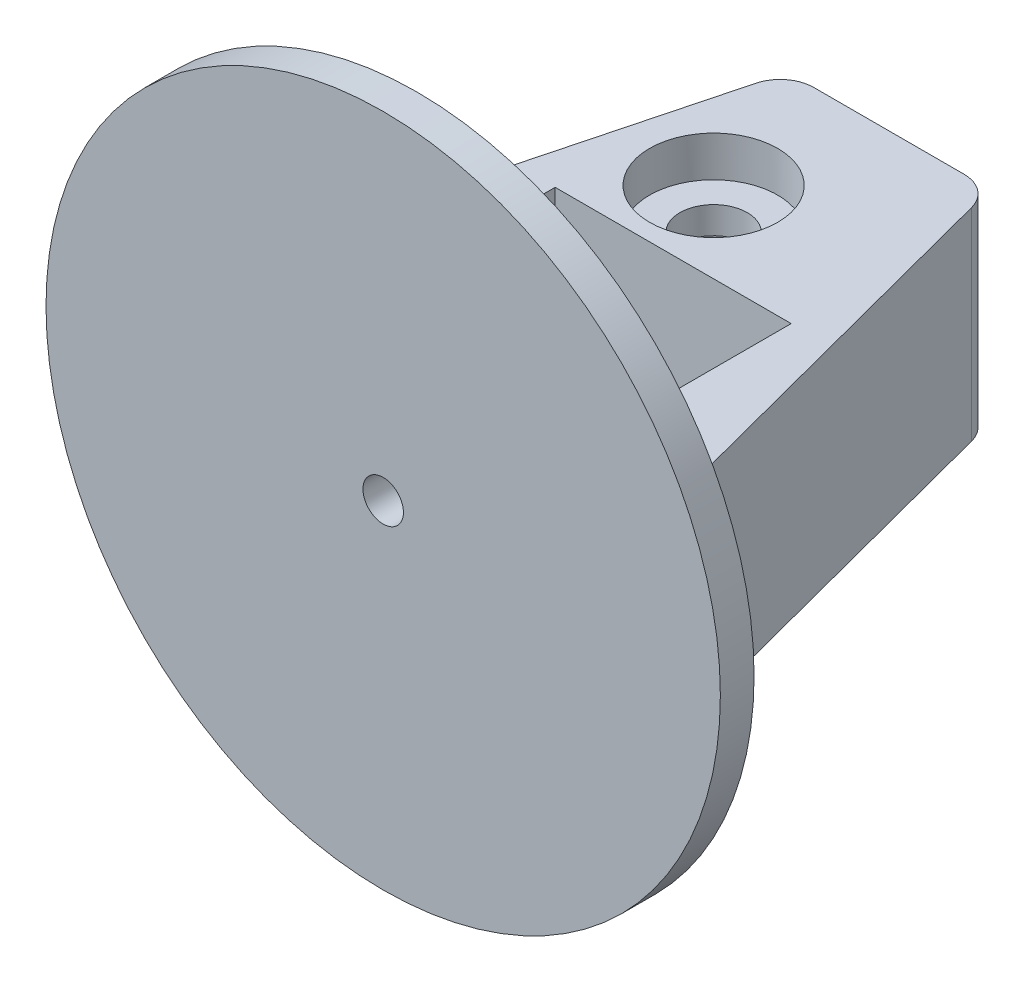
ISO-10303-21;
HEADER;
FILE_DESCRIPTION(('STEP AP214'),'2;1');
FILE_NAME('part.step','',(''),(''),'','','');
FILE_SCHEMA(('AUTOMOTIVE_DESIGN { 1 0 10303 214 1 1 1 1 }'));
ENDSEC;
DATA;
#1=APPLICATION_CONTEXT('core data for automotive mechanical design processes');
#2=APPLICATION_PROTOCOL_DEFINITION('international standard','automotive_design',2000,#1);
#3=PRODUCT_CONTEXT('',#1,'mechanical');
#4=PRODUCT('Part','Part','',(#3));
#5=PRODUCT_RELATED_PRODUCT_CATEGORY('part','',(#4));
#6=PRODUCT_DEFINITION_FORMATION('','',#4);
#7=PRODUCT_DEFINITION_CONTEXT('part definition',#1,'design');
#8=PRODUCT_DEFINITION('design','',#6,#7);
#9=PRODUCT_DEFINITION_SHAPE('','',#8);
#10=(LENGTH_UNIT() NAMED_UNIT(*) SI_UNIT(.MILLI.,.METRE.));
#11=(NAMED_UNIT(*) PLANE_ANGLE_UNIT() SI_UNIT($,.RADIAN.));
#12=(NAMED_UNIT(*) SI_UNIT($,.STERADIAN.) SOLID_ANGLE_UNIT());
#13=UNCERTAINTY_MEASURE_WITH_UNIT(LENGTH_MEASURE(1.E-05),#10,'distance_accuracy_value','');
#14=(GEOMETRIC_REPRESENTATION_CONTEXT(3) GLOBAL_UNCERTAINTY_ASSIGNED_CONTEXT((#13)) GLOBAL_UNIT_ASSIGNED_CONTEXT((#10,
#11,#12)) REPRESENTATION_CONTEXT('',''));
#15=CARTESIAN_POINT('',(0.,0.,0.));
#16=DIRECTION('',(0.,0.,1.));
#17=DIRECTION('',(1.,0.,0.));
#18=AXIS2_PLACEMENT_3D('',#15,#16,#17);
#19=CARTESIAN_POINT('',(-5.99999999999999,40.,-50.));
#20=DIRECTION('',(0.,-1.,0.));
#21=DIRECTION('',(0.,0.,-1.));
#22=AXIS2_PLACEMENT_3D('',#19,#20,#21);
#23=CYLINDRICAL_SURFACE('',#22,5.);
#24=CARTESIAN_POINT('',(-5.99999999999999,20.,-50.));
#25=DIRECTION('',(0.,-1.,0.));
#26=DIRECTION('',(0.,0.,-1.));
#27=AXIS2_PLACEMENT_3D('',#24,#25,#26);
#28=CIRCLE('',#27,5.);
#29=CARTESIAN_POINT('',(-5.99999999999999,20.,-55.));
#30=VERTEX_POINT('',#29);
#31=EDGE_CURVE('E146',#30,#30,#28,.T.);
#32=ORIENTED_EDGE('',*,*,#31,.T.);
#33=EDGE_LOOP('',(#32));
#34=FACE_BOUND('',#33,.T.);
#35=CARTESIAN_POINT('',(-5.99999999999999,24.,-50.));
#36=DIRECTION('',(0.,1.,0.));
#37=DIRECTION('',(0.,0.,1.));
#38=AXIS2_PLACEMENT_3D('',#35,#36,#37);
#39=CIRCLE('',#38,5.);
#40=CARTESIAN_POINT('',(-5.99999999999999,24.,-45.));
#41=VERTEX_POINT('',#40);
#42=EDGE_CURVE('E144',#41,#41,#39,.F.);
#43=ORIENTED_EDGE('',*,*,#42,.F.);
#44=EDGE_LOOP('',(#43));
#45=FACE_BOUND('',#44,.T.);
#46=ADVANCED_FACE('F36',(#34,#45),#23,.F.);
#47=CARTESIAN_POINT('',(-11.141347684202,40.,-65.));
#48=DIRECTION('',(0.,-1.,0.));
#49=DIRECTION('',(0.,0.,-1.));
#50=AXIS2_PLACEMENT_3D('',#47,#48,#49);
#51=CYLINDRICAL_SURFACE('',#50,5.);
#52=DIRECTION('',(0.,-1.,0.));
#53=VECTOR('',#52,1.);
#54=CARTESIAN_POINT('',(-15.978061053794,40.,-66.2673609511146));
#55=LINE('',#54,#53);
#56=CARTESIAN_POINT('',(-15.978061053794,30.,-66.2673609511146));
#57=VERTEX_POINT('',#56);
#58=CARTESIAN_POINT('',(-15.978061053794,0.,-66.2673609511146));
#59=VERTEX_POINT('',#58);
#60=EDGE_CURVE('E11',#57,#59,#55,.T.);
#61=ORIENTED_EDGE('',*,*,#60,.F.);
#62=CARTESIAN_POINT('',(-11.141347684202,30.,-65.));
#63=DIRECTION('',(0.,-1.,0.));
#64=DIRECTION('',(0.,0.,-1.));
#65=AXIS2_PLACEMENT_3D('',#62,#63,#64);
#66=CIRCLE('',#65,5.);
#67=CARTESIAN_POINT('',(-11.141347684202,30.,-70.));
#68=VERTEX_POINT('',#67);
#69=EDGE_CURVE('E120',#57,#68,#66,.T.);
#70=ORIENTED_EDGE('',*,*,#69,.T.);
#71=DIRECTION('',(0.,-1.,0.));
#72=VECTOR('',#71,1.);
#73=CARTESIAN_POINT('',(-11.141347684202,40.,-70.));
#74=LINE('',#73,#72);
#75=CARTESIAN_POINT('',(-11.141347684202,0.,-70.));
#76=VERTEX_POINT('',#75);
#77=EDGE_CURVE('E185',#68,#76,#74,.T.);
#78=ORIENTED_EDGE('',*,*,#77,.T.);
#79=CARTESIAN_POINT('',(-11.141347684202,0.,-65.));
#80=DIRECTION('',(0.,1.,0.));
#81=DIRECTION('',(0.,0.,1.));
#82=AXIS2_PLACEMENT_3D('',#79,#80,#81);
#83=CIRCLE('',#82,5.);
#84=EDGE_CURVE('E168',#76,#59,#83,.T.);
#85=ORIENTED_EDGE('',*,*,#84,.T.);
#86=EDGE_LOOP('',(#61,#70,#78,#85));
#87=FACE_BOUND('',#86,.T.);
#88=ADVANCED_FACE('F38',(#87),#51,.T.);
#89=CARTESIAN_POINT('',(-33.3420558133058,40.,0.));
#90=DIRECTION('',(0.9673426739184,0.,0.253472190222911));
#91=DIRECTION('',(0.253472190222911,0.,-0.9673426739184));
#92=AXIS2_PLACEMENT_3D('',#89,#90,#91);
#93=PLANE('',#92);
#94=DIRECTION('',(0.,-1.,0.));
#95=VECTOR('',#94,1.);
#96=CARTESIAN_POINT('',(-33.3420558133058,40.,0.));
#97=LINE('',#96,#95);
#98=CARTESIAN_POINT('',(-33.3420558133058,30.,0.));
#99=VERTEX_POINT('',#98);
#100=CARTESIAN_POINT('',(-33.3420558133058,0.,0.));
#101=VERTEX_POINT('',#100);
#102=EDGE_CURVE('E45',#99,#101,#97,.T.);
#103=ORIENTED_EDGE('',*,*,#102,.F.);
#104=DIRECTION('',(0.253472190222911,0.,-0.9673426739184));
#105=VECTOR('',#104,1.);
#106=CARTESIAN_POINT('',(-33.3420558133058,30.,0.));
#107=LINE('',#106,#105);
#108=EDGE_CURVE('E114',#99,#57,#107,.T.);
#109=ORIENTED_EDGE('',*,*,#108,.T.);
#110=ORIENTED_EDGE('',*,*,#60,.T.);
#111=DIRECTION('',(-0.253472190222911,0.,0.9673426739184));
#112=VECTOR('',#111,1.);
#113=CARTESIAN_POINT('',(-33.3420558133058,0.,0.));
#114=LINE('',#113,#112);
#115=EDGE_CURVE('E139',#59,#101,#114,.T.);
#116=ORIENTED_EDGE('',*,*,#115,.T.);
#117=EDGE_LOOP('',(#103,#109,#110,#116));
#118=FACE_BOUND('',#117,.T.);
#119=ADVANCED_FACE('F137',(#118),#93,.F.);
#120=CARTESIAN_POINT('',(15.978061053794,40.,-66.2673609511146));
#121=DIRECTION('',(-0.9673426739184,0.,0.253472190222911));
#122=DIRECTION('',(0.253472190222911,0.,0.9673426739184));
#123=AXIS2_PLACEMENT_3D('',#120,#121,#122);
#124=PLANE('',#123);
#125=DIRECTION('',(0.,-1.,0.));
#126=VECTOR('',#125,1.);
#127=CARTESIAN_POINT('',(15.978061053794,40.,-66.2673609511146));
#128=LINE('',#127,#126);
#129=CARTESIAN_POINT('',(15.978061053794,30.,-66.2673609511146));
#130=VERTEX_POINT('',#129);
#131=CARTESIAN_POINT('',(15.978061053794,0.,-66.2673609511146));
#132=VERTEX_POINT('',#131);
#133=EDGE_CURVE('E141',#130,#132,#128,.T.);
#134=ORIENTED_EDGE('',*,*,#133,.F.);
#135=DIRECTION('',(0.253472190222911,0.,0.9673426739184));
#136=VECTOR('',#135,1.);
#137=CARTESIAN_POINT('',(15.978061053794,30.,-66.2673609511146));
#138=LINE('',#137,#136);
#139=CARTESIAN_POINT('',(33.3420558133058,30.,0.));
#140=VERTEX_POINT('',#139);
#141=EDGE_CURVE('E209',#130,#140,#138,.T.);
#142=ORIENTED_EDGE('',*,*,#141,.T.);
#143=DIRECTION('',(0.,-1.,0.));
#144=VECTOR('',#143,1.);
#145=CARTESIAN_POINT('',(33.3420558133058,40.,0.));
#146=LINE('',#145,#144);
#147=CARTESIAN_POINT('',(33.3420558133058,0.,0.));
#148=VERTEX_POINT('',#147);
#149=EDGE_CURVE('E132',#140,#148,#146,.T.);
#150=ORIENTED_EDGE('',*,*,#149,.T.);
#151=DIRECTION('',(-0.253472190222911,0.,-0.9673426739184));
#152=VECTOR('',#151,1.);
#153=CARTESIAN_POINT('',(15.978061053794,0.,-66.2673609511146));
#154=LINE('',#153,#152);
#155=EDGE_CURVE('E176',#148,#132,#154,.T.);
#156=ORIENTED_EDGE('',*,*,#155,.T.);
#157=EDGE_LOOP('',(#134,#142,#150,#156));
#158=FACE_BOUND('',#157,.T.);
#159=ADVANCED_FACE('F198',(#158),#124,.F.);
#160=CARTESIAN_POINT('',(11.141347684202,40.,-65.));
#161=DIRECTION('',(0.,-1.,0.));
#162=DIRECTION('',(0.,0.,-1.));
#163=AXIS2_PLACEMENT_3D('',#160,#161,#162);
#164=CYLINDRICAL_SURFACE('',#163,5.);
#165=DIRECTION('',(0.,-1.,0.));
#166=VECTOR('',#165,1.);
#167=CARTESIAN_POINT('',(11.141347684202,40.,-70.));
#168=LINE('',#167,#166);
#169=CARTESIAN_POINT('',(11.141347684202,30.,-70.));
#170=VERTEX_POINT('',#169);
#171=CARTESIAN_POINT('',(11.141347684202,0.,-70.));
#172=VERTEX_POINT('',#171);
#173=EDGE_CURVE('E187',#170,#172,#168,.T.);
#174=ORIENTED_EDGE('',*,*,#173,.F.);
#175=CARTESIAN_POINT('',(11.141347684202,30.,-65.));
#176=DIRECTION('',(0.,-1.,0.));
#177=DIRECTION('',(0.,0.,-1.));
#178=AXIS2_PLACEMENT_3D('',#175,#176,#177);
#179=CIRCLE('',#178,5.);
#180=EDGE_CURVE('E195',#170,#130,#179,.T.);
#181=ORIENTED_EDGE('',*,*,#180,.T.);
#182=ORIENTED_EDGE('',*,*,#133,.T.);
#183=CARTESIAN_POINT('',(11.141347684202,0.,-65.));
#184=DIRECTION('',(0.,1.,0.));
#185=DIRECTION('',(0.,0.,-1.));
#186=AXIS2_PLACEMENT_3D('',#183,#184,#185);
#187=CIRCLE('',#186,5.);
#188=EDGE_CURVE('E179',#132,#172,#187,.T.);
#189=ORIENTED_EDGE('',*,*,#188,.T.);
#190=EDGE_LOOP('',(#174,#181,#182,#189));
#191=FACE_BOUND('',#190,.T.);
#192=ADVANCED_FACE('F192',(#191),#164,.T.);
#193=CARTESIAN_POINT('',(-11.141347684202,40.,-70.));
#194=DIRECTION('',(0.,0.,1.));
#195=DIRECTION('',(1.,0.,0.));
#196=AXIS2_PLACEMENT_3D('',#193,#194,#195);
#197=PLANE('',#196);
#198=ORIENTED_EDGE('',*,*,#77,.F.);
#199=DIRECTION('',(1.,0.,0.));
#200=VECTOR('',#199,1.);
#201=CARTESIAN_POINT('',(-11.141347684202,30.,-70.));
#202=LINE('',#201,#200);
#203=EDGE_CURVE('E206',#68,#170,#202,.T.);
#204=ORIENTED_EDGE('',*,*,#203,.T.);
#205=ORIENTED_EDGE('',*,*,#173,.T.);
#206=DIRECTION('',(-1.,0.,0.));
#207=VECTOR('',#206,1.);
#208=CARTESIAN_POINT('',(-11.141347684202,0.,-70.));
#209=LINE('',#208,#207);
#210=EDGE_CURVE('E182',#172,#76,#209,.T.);
#211=ORIENTED_EDGE('',*,*,#210,.T.);
#212=EDGE_LOOP('',(#198,#204,#205,#211));
#213=FACE_BOUND('',#212,.T.);
#214=ADVANCED_FACE('F204',(#213),#197,.F.);
#215=CARTESIAN_POINT('',(-11.141347684202,0.,-65.));
#216=DIRECTION('',(0.,1.,0.));
#217=DIRECTION('',(0.,0.,1.));
#218=AXIS2_PLACEMENT_3D('',#215,#216,#217);
#219=PLANE('',#218);
#220=CARTESIAN_POINT('',(-11.3501899868682,0.,-14.3499999999996));
#221=DIRECTION('',(0.,-1.,0.));
#222=DIRECTION('',(0.,0.,-1.));
#223=AXIS2_PLACEMENT_3D('',#220,#221,#222);
#224=CIRCLE('',#223,1.50000000000009);
#225=CARTESIAN_POINT('',(-11.3501899868682,0.,-15.8499999999997));
#226=VERTEX_POINT('',#225);
#227=EDGE_CURVE('E270',#226,#226,#224,.T.);
#228=ORIENTED_EDGE('',*,*,#227,.F.);
#229=EDGE_LOOP('',(#228));
#230=FACE_BOUND('',#229,.T.);
#231=CARTESIAN_POINT('',(-1.35018998686818,0.,-14.3499999999996));
#232=DIRECTION('',(0.,-1.,0.));
#233=DIRECTION('',(0.,0.,-1.));
#234=AXIS2_PLACEMENT_3D('',#231,#232,#233);
#235=CIRCLE('',#234,1.5000000000001);
#236=CARTESIAN_POINT('',(-1.35018998686818,0.,-15.8499999999997));
#237=VERTEX_POINT('',#236);
#238=EDGE_CURVE('E264',#237,#237,#235,.T.);
#239=ORIENTED_EDGE('',*,*,#238,.F.);
#240=EDGE_LOOP('',(#239));
#241=FACE_BOUND('',#240,.T.);
#242=CARTESIAN_POINT('',(-1.35018998686803,0.,-64.8499999999998));
#243=DIRECTION('',(0.,-1.,0.));
#244=DIRECTION('',(0.,0.,-1.));
#245=AXIS2_PLACEMENT_3D('',#242,#243,#244);
#246=CIRCLE('',#245,1.5);
#247=CARTESIAN_POINT('',(-1.35018998686803,0.,-66.3499999999998));
#248=VERTEX_POINT('',#247);
#249=EDGE_CURVE('E259',#248,#248,#246,.T.);
#250=ORIENTED_EDGE('',*,*,#249,.F.);
#251=EDGE_LOOP('',(#250));
#252=FACE_BOUND('',#251,.T.);
#253=CARTESIAN_POINT('',(-11.350189986868,0.,-64.8499999999998));
#254=DIRECTION('',(0.,-1.,0.));
#255=DIRECTION('',(0.,0.,-1.));
#256=AXIS2_PLACEMENT_3D('',#253,#254,#255);
#257=CIRCLE('',#256,1.5);
#258=CARTESIAN_POINT('',(-11.350189986868,0.,-66.3499999999998));
#259=VERTEX_POINT('',#258);
#260=EDGE_CURVE('E252',#259,#259,#257,.T.);
#261=ORIENTED_EDGE('',*,*,#260,.F.);
#262=EDGE_LOOP('',(#261));
#263=FACE_BOUND('',#262,.T.);
#264=DIRECTION('',(1.,0.,0.));
#265=VECTOR('',#264,1.);
#266=CARTESIAN_POINT('',(-17.5,0.,-18.));
#267=LINE('',#266,#265);
#268=CARTESIAN_POINT('',(-17.5,0.,-18.));
#269=VERTEX_POINT('',#268);
#270=CARTESIAN_POINT('',(17.5,0.,-18.));
#271=VERTEX_POINT('',#270);
#272=EDGE_CURVE('E233',#269,#271,#267,.T.);
#273=ORIENTED_EDGE('',*,*,#272,.T.);
#274=DIRECTION('',(0.,0.,-1.));
#275=VECTOR('',#274,1.);
#276=CARTESIAN_POINT('',(17.5,0.,-18.));
#277=LINE('',#276,#275);
#278=CARTESIAN_POINT('',(17.5,0.,-38.));
#279=VERTEX_POINT('',#278);
#280=EDGE_CURVE('E226',#271,#279,#277,.T.);
#281=ORIENTED_EDGE('',*,*,#280,.T.);
#282=DIRECTION('',(-1.,0.,0.));
#283=VECTOR('',#282,1.);
#284=CARTESIAN_POINT('',(-17.5,0.,-38.));
#285=LINE('',#284,#283);
#286=CARTESIAN_POINT('',(-17.5,0.,-38.));
#287=VERTEX_POINT('',#286);
#288=EDGE_CURVE('E229',#279,#287,#285,.T.);
#289=ORIENTED_EDGE('',*,*,#288,.T.);
#290=DIRECTION('',(0.,0.,1.));
#291=VECTOR('',#290,1.);
#292=CARTESIAN_POINT('',(-17.5,0.,-18.));
#293=LINE('',#292,#291);
#294=EDGE_CURVE('E61',#287,#269,#293,.T.);
#295=ORIENTED_EDGE('',*,*,#294,.T.);
#296=EDGE_LOOP('',(#273,#281,#289,#295));
#297=FACE_BOUND('',#296,.T.);
#298=CARTESIAN_POINT('',(-5.99999999999999,0.,-50.));
#299=DIRECTION('',(0.,-1.,0.));
#300=DIRECTION('',(0.,0.,-1.));
#301=AXIS2_PLACEMENT_3D('',#298,#299,#300);
#302=CIRCLE('',#301,9.5);
#303=CARTESIAN_POINT('',(-5.99999999999999,0.,-59.5));
#304=VERTEX_POINT('',#303);
#305=EDGE_CURVE('E151',#304,#304,#302,.T.);
#306=ORIENTED_EDGE('',*,*,#305,.F.);
#307=EDGE_LOOP('',(#306));
#308=FACE_BOUND('',#307,.T.);
#309=ORIENTED_EDGE('',*,*,#84,.F.);
#310=ORIENTED_EDGE('',*,*,#210,.F.);
#311=ORIENTED_EDGE('',*,*,#188,.F.);
#312=ORIENTED_EDGE('',*,*,#155,.F.);
#313=DIRECTION('',(1.,0.,0.));
#314=VECTOR('',#313,1.);
#315=CARTESIAN_POINT('',(33.3420558133058,0.,0.));
#316=LINE('',#315,#314);
#317=EDGE_CURVE('E174',#101,#148,#316,.T.);
#318=ORIENTED_EDGE('',*,*,#317,.F.);
#319=ORIENTED_EDGE('',*,*,#115,.F.);
#320=EDGE_LOOP('',(#309,#310,#311,#312,#318,#319));
#321=FACE_BOUND('',#320,.T.);
#322=ADVANCED_FACE('F201',(#230,#241,#252,#263,#297,#308,#321),#219,.F.);
#323=CARTESIAN_POINT('',(-5.99999999999999,20.,-50.));
#324=DIRECTION('',(0.,-1.,0.));
#325=DIRECTION('',(0.,0.,-1.));
#326=AXIS2_PLACEMENT_3D('',#323,#324,#325);
#327=CYLINDRICAL_SURFACE('',#326,9.5);
#328=CARTESIAN_POINT('',(-5.99999999999999,20.,-50.));
#329=DIRECTION('',(0.,-1.,0.));
#330=DIRECTION('',(0.,0.,-1.));
#331=AXIS2_PLACEMENT_3D('',#328,#329,#330);
#332=CIRCLE('',#331,9.5);
#333=CARTESIAN_POINT('',(-5.99999999999999,20.,-59.5));
#334=VERTEX_POINT('',#333);
#335=EDGE_CURVE('E165',#334,#334,#332,.T.);
#336=ORIENTED_EDGE('',*,*,#335,.F.);
#337=EDGE_LOOP('',(#336));
#338=FACE_BOUND('',#337,.T.);
#339=ORIENTED_EDGE('',*,*,#305,.T.);
#340=EDGE_LOOP('',(#339));
#341=FACE_BOUND('',#340,.T.);
#342=ADVANCED_FACE('F287',(#338,#341),#327,.F.);
#343=CARTESIAN_POINT('',(-5.99999999999999,20.,-50.));
#344=DIRECTION('',(0.,-1.,0.));
#345=DIRECTION('',(0.,0.,-1.));
#346=AXIS2_PLACEMENT_3D('',#343,#344,#345);
#347=PLANE('',#346);
#348=ORIENTED_EDGE('',*,*,#31,.F.);
#349=EDGE_LOOP('',(#348));
#350=FACE_BOUND('',#349,.T.);
#351=ORIENTED_EDGE('',*,*,#335,.T.);
#352=EDGE_LOOP('',(#351));
#353=FACE_BOUND('',#352,.T.);
#354=ADVANCED_FACE('F300',(#350,#353),#347,.T.);
#355=CARTESIAN_POINT('',(-5.99999999999999,24.,-50.));
#356=DIRECTION('',(0.,1.,0.));
#357=DIRECTION('',(0.,0.,1.));
#358=AXIS2_PLACEMENT_3D('',#355,#356,#357);
#359=PLANE('',#358);
#360=CARTESIAN_POINT('',(-5.99999999999999,24.,-50.));
#361=DIRECTION('',(0.,1.,0.));
#362=DIRECTION('',(0.,0.,1.));
#363=AXIS2_PLACEMENT_3D('',#360,#361,#362);
#364=CIRCLE('',#363,9.5);
#365=CARTESIAN_POINT('',(-5.99999999999999,24.,-40.5));
#366=VERTEX_POINT('',#365);
#367=EDGE_CURVE('E147',#366,#366,#364,.T.);
#368=ORIENTED_EDGE('',*,*,#367,.T.);
#369=EDGE_LOOP('',(#368));
#370=FACE_BOUND('',#369,.T.);
#371=ORIENTED_EDGE('',*,*,#42,.T.);
#372=EDGE_LOOP('',(#371));
#373=FACE_BOUND('',#372,.T.);
#374=ADVANCED_FACE('F307',(#370,#373),#359,.T.);
#375=CARTESIAN_POINT('',(-5.99999999999999,24.,-50.));
#376=DIRECTION('',(0.,1.,0.));
#377=DIRECTION('',(0.,0.,1.));
#378=AXIS2_PLACEMENT_3D('',#375,#376,#377);
#379=CYLINDRICAL_SURFACE('',#378,9.5);
#380=CARTESIAN_POINT('',(-5.99999999999999,30.,-50.));
#381=DIRECTION('',(0.,-1.,0.));
#382=DIRECTION('',(0.,0.,-1.));
#383=AXIS2_PLACEMENT_3D('',#380,#381,#382);
#384=CIRCLE('',#383,9.5);
#385=CARTESIAN_POINT('',(-5.99999999999999,30.,-59.5));
#386=VERTEX_POINT('',#385);
#387=EDGE_CURVE('E207',#386,#386,#384,.F.);
#388=ORIENTED_EDGE('',*,*,#387,.T.);
#389=EDGE_LOOP('',(#388));
#390=FACE_BOUND('',#389,.T.);
#391=ORIENTED_EDGE('',*,*,#367,.F.);
#392=EDGE_LOOP('',(#391));
#393=FACE_BOUND('',#392,.T.);
#394=ADVANCED_FACE('F320',(#390,#393),#379,.F.);
#395=CARTESIAN_POINT('',(17.5,0.,-18.));
#396=DIRECTION('',(1.,0.,0.));
#397=DIRECTION('',(0.,0.,-1.));
#398=AXIS2_PLACEMENT_3D('',#395,#396,#397);
#399=PLANE('',#398);
#400=DIRECTION('',(0.,1.,0.));
#401=VECTOR('',#400,1.);
#402=CARTESIAN_POINT('',(17.5,0.,-18.));
#403=LINE('',#402,#401);
#404=CARTESIAN_POINT('',(17.5,30.,-18.));
#405=VERTEX_POINT('',#404);
#406=EDGE_CURVE('E154',#271,#405,#403,.T.);
#407=ORIENTED_EDGE('',*,*,#406,.T.);
#408=DIRECTION('',(0.,0.,-1.));
#409=VECTOR('',#408,1.);
#410=CARTESIAN_POINT('',(17.5,30.,-18.));
#411=LINE('',#410,#409);
#412=CARTESIAN_POINT('',(17.5,30.,-38.));
#413=VERTEX_POINT('',#412);
#414=EDGE_CURVE('E212',#405,#413,#411,.T.);
#415=ORIENTED_EDGE('',*,*,#414,.T.);
#416=DIRECTION('',(0.,1.,0.));
#417=VECTOR('',#416,1.);
#418=CARTESIAN_POINT('',(17.5,0.,-38.));
#419=LINE('',#418,#417);
#420=EDGE_CURVE('E162',#279,#413,#419,.T.);
#421=ORIENTED_EDGE('',*,*,#420,.F.);
#422=ORIENTED_EDGE('',*,*,#280,.F.);
#423=EDGE_LOOP('',(#407,#415,#421,#422));
#424=FACE_BOUND('',#423,.T.);
#425=ADVANCED_FACE('F245',(#424),#399,.F.);
#426=CARTESIAN_POINT('',(-17.5,0.,-18.));
#427=DIRECTION('',(0.,0.,1.));
#428=DIRECTION('',(1.,0.,0.));
#429=AXIS2_PLACEMENT_3D('',#426,#427,#428);
#430=PLANE('',#429);
#431=CARTESIAN_POINT('',(0.,20.,-18.));
#432=DIRECTION('',(0.,0.,1.));
#433=DIRECTION('',(1.,0.,0.));
#434=AXIS2_PLACEMENT_3D('',#431,#432,#433);
#435=CIRCLE('',#434,3.);
#436=CARTESIAN_POINT('',(3.,20.,-18.));
#437=VERTEX_POINT('',#436);
#438=EDGE_CURVE('E40',#437,#437,#435,.T.);
#439=ORIENTED_EDGE('',*,*,#438,.T.);
#440=EDGE_LOOP('',(#439));
#441=FACE_BOUND('',#440,.T.);
#442=DIRECTION('',(0.,1.,0.));
#443=VECTOR('',#442,1.);
#444=CARTESIAN_POINT('',(-17.5,0.,-18.));
#445=LINE('',#444,#443);
#446=CARTESIAN_POINT('',(-17.5,30.,-18.));
#447=VERTEX_POINT('',#446);
#448=EDGE_CURVE('E159',#269,#447,#445,.T.);
#449=ORIENTED_EDGE('',*,*,#448,.T.);
#450=DIRECTION('',(1.,0.,0.));
#451=VECTOR('',#450,1.);
#452=CARTESIAN_POINT('',(-17.5,30.,-18.));
#453=LINE('',#452,#451);
#454=EDGE_CURVE('E247',#447,#405,#453,.T.);
#455=ORIENTED_EDGE('',*,*,#454,.T.);
#456=ORIENTED_EDGE('',*,*,#406,.F.);
#457=ORIENTED_EDGE('',*,*,#272,.F.);
#458=EDGE_LOOP('',(#449,#455,#456,#457));
#459=FACE_BOUND('',#458,.T.);
#460=ADVANCED_FACE('F328',(#441,#459),#430,.F.);
#461=CARTESIAN_POINT('',(-17.5,0.,-18.));
#462=DIRECTION('',(-1.,0.,0.));
#463=DIRECTION('',(0.,0.,1.));
#464=AXIS2_PLACEMENT_3D('',#461,#462,#463);
#465=PLANE('',#464);
#466=DIRECTION('',(0.,1.,0.));
#467=VECTOR('',#466,1.);
#468=CARTESIAN_POINT('',(-17.5,0.,-38.));
#469=LINE('',#468,#467);
#470=CARTESIAN_POINT('',(-17.5,30.,-38.));
#471=VERTEX_POINT('',#470);
#472=EDGE_CURVE('E237',#287,#471,#469,.T.);
#473=ORIENTED_EDGE('',*,*,#472,.T.);
#474=DIRECTION('',(0.,0.,1.));
#475=VECTOR('',#474,1.);
#476=CARTESIAN_POINT('',(-17.5,30.,-18.));
#477=LINE('',#476,#475);
#478=EDGE_CURVE('E53',#471,#447,#477,.T.);
#479=ORIENTED_EDGE('',*,*,#478,.T.);
#480=ORIENTED_EDGE('',*,*,#448,.F.);
#481=ORIENTED_EDGE('',*,*,#294,.F.);
#482=EDGE_LOOP('',(#473,#479,#480,#481));
#483=FACE_BOUND('',#482,.T.);
#484=ADVANCED_FACE('F332',(#483),#465,.F.);
#485=CARTESIAN_POINT('',(-17.5,0.,-38.));
#486=DIRECTION('',(0.,0.,-1.));
#487=DIRECTION('',(-1.,0.,0.));
#488=AXIS2_PLACEMENT_3D('',#485,#486,#487);
#489=PLANE('',#488);
#490=ORIENTED_EDGE('',*,*,#420,.T.);
#491=DIRECTION('',(-1.,0.,0.));
#492=VECTOR('',#491,1.);
#493=CARTESIAN_POINT('',(-17.5,30.,-38.));
#494=LINE('',#493,#492);
#495=EDGE_CURVE('E133',#413,#471,#494,.T.);
#496=ORIENTED_EDGE('',*,*,#495,.T.);
#497=ORIENTED_EDGE('',*,*,#472,.F.);
#498=ORIENTED_EDGE('',*,*,#288,.F.);
#499=EDGE_LOOP('',(#490,#496,#497,#498));
#500=FACE_BOUND('',#499,.T.);
#501=ADVANCED_FACE('F241',(#500),#489,.F.);
#502=CARTESIAN_POINT('',(0.,20.,-25.));
#503=DIRECTION('',(0.,0.,1.));
#504=DIRECTION('',(1.,0.,0.));
#505=AXIS2_PLACEMENT_3D('',#502,#503,#504);
#506=CYLINDRICAL_SURFACE('',#505,3.);
#507=ORIENTED_EDGE('',*,*,#438,.F.);
#508=EDGE_LOOP('',(#507));
#509=FACE_BOUND('',#508,.T.);
#510=CARTESIAN_POINT('',(0.,20.,5.));
#511=DIRECTION('',(0.,0.,1.));
#512=DIRECTION('',(1.,0.,0.));
#513=AXIS2_PLACEMENT_3D('',#510,#511,#512);
#514=CIRCLE('',#513,3.);
#515=CARTESIAN_POINT('',(3.,20.,5.));
#516=VERTEX_POINT('',#515);
#517=EDGE_CURVE('E124',#516,#516,#514,.T.);
#518=ORIENTED_EDGE('',*,*,#517,.T.);
#519=EDGE_LOOP('',(#518));
#520=FACE_BOUND('',#519,.T.);
#521=ADVANCED_FACE('F331',(#509,#520),#506,.F.);
#522=CARTESIAN_POINT('',(0.,20.,0.));
#523=DIRECTION('',(0.,0.,1.));
#524=DIRECTION('',(1.,0.,0.));
#525=AXIS2_PLACEMENT_3D('',#522,#523,#524);
#526=PLANE('',#525);
#527=ORIENTED_EDGE('',*,*,#149,.F.);
#528=DIRECTION('',(1.,0.,0.));
#529=VECTOR('',#528,1.);
#530=CARTESIAN_POINT('',(-33.3420558133058,30.,0.));
#531=LINE('',#530,#529);
#532=EDGE_CURVE('E117',#99,#140,#531,.T.);
#533=ORIENTED_EDGE('',*,*,#532,.F.);
#534=ORIENTED_EDGE('',*,*,#102,.T.);
#535=ORIENTED_EDGE('',*,*,#317,.T.);
#536=EDGE_LOOP('',(#527,#533,#534,#535));
#537=FACE_BOUND('',#536,.T.);
#538=CARTESIAN_POINT('',(0.,20.,0.));
#539=DIRECTION('',(0.,0.,1.));
#540=DIRECTION('',(1.,0.,0.));
#541=AXIS2_PLACEMENT_3D('',#538,#539,#540);
#542=CIRCLE('',#541,50.);
#543=CARTESIAN_POINT('',(50.,20.,0.));
#544=VERTEX_POINT('',#543);
#545=EDGE_CURVE('E220',#544,#544,#542,.T.);
#546=ORIENTED_EDGE('',*,*,#545,.F.);
#547=EDGE_LOOP('',(#546));
#548=FACE_BOUND('',#547,.T.);
#549=ADVANCED_FACE('F128',(#537,#548),#526,.F.);
#550=CARTESIAN_POINT('',(0.,20.,5.));
#551=DIRECTION('',(0.,0.,1.));
#552=DIRECTION('',(1.,0.,0.));
#553=AXIS2_PLACEMENT_3D('',#550,#551,#552);
#554=PLANE('',#553);
#555=CARTESIAN_POINT('',(0.,20.,5.));
#556=DIRECTION('',(0.,0.,1.));
#557=DIRECTION('',(1.,0.,0.));
#558=AXIS2_PLACEMENT_3D('',#555,#556,#557);
#559=CIRCLE('',#558,50.);
#560=CARTESIAN_POINT('',(50.,20.,5.));
#561=VERTEX_POINT('',#560);
#562=EDGE_CURVE('E221',#561,#561,#559,.T.);
#563=ORIENTED_EDGE('',*,*,#562,.T.);
#564=EDGE_LOOP('',(#563));
#565=FACE_BOUND('',#564,.T.);
#566=ORIENTED_EDGE('',*,*,#517,.F.);
#567=EDGE_LOOP('',(#566));
#568=FACE_BOUND('',#567,.T.);
#569=ADVANCED_FACE('F344',(#565,#568),#554,.T.);
#570=CARTESIAN_POINT('',(0.,20.,5.));
#571=DIRECTION('',(0.,0.,-1.));
#572=DIRECTION('',(-1.,0.,0.));
#573=AXIS2_PLACEMENT_3D('',#570,#571,#572);
#574=CYLINDRICAL_SURFACE('',#573,50.);
#575=ORIENTED_EDGE('',*,*,#562,.F.);
#576=EDGE_LOOP('',(#575));
#577=FACE_BOUND('',#576,.T.);
#578=ORIENTED_EDGE('',*,*,#545,.T.);
#579=EDGE_LOOP('',(#578));
#580=FACE_BOUND('',#579,.T.);
#581=ADVANCED_FACE('F341',(#577,#580),#574,.T.);
#582=CARTESIAN_POINT('',(0.,30.,0.));
#583=DIRECTION('',(0.,-1.,0.));
#584=DIRECTION('',(0.,0.,-1.));
#585=AXIS2_PLACEMENT_3D('',#582,#583,#584);
#586=PLANE('',#585);
#587=ORIENTED_EDGE('',*,*,#454,.F.);
#588=ORIENTED_EDGE('',*,*,#478,.F.);
#589=ORIENTED_EDGE('',*,*,#495,.F.);
#590=ORIENTED_EDGE('',*,*,#414,.F.);
#591=EDGE_LOOP('',(#587,#588,#589,#590));
#592=FACE_BOUND('',#591,.T.);
#593=ORIENTED_EDGE('',*,*,#387,.F.);
#594=EDGE_LOOP('',(#593));
#595=FACE_BOUND('',#594,.T.);
#596=ORIENTED_EDGE('',*,*,#532,.T.);
#597=ORIENTED_EDGE('',*,*,#141,.F.);
#598=ORIENTED_EDGE('',*,*,#180,.F.);
#599=ORIENTED_EDGE('',*,*,#203,.F.);
#600=ORIENTED_EDGE('',*,*,#69,.F.);
#601=ORIENTED_EDGE('',*,*,#108,.F.);
#602=EDGE_LOOP('',(#596,#597,#598,#599,#600,#601));
#603=FACE_BOUND('',#602,.T.);
#604=ADVANCED_FACE('F116',(#592,#595,#603),#586,.F.);
#605=CARTESIAN_POINT('',(-11.350189986868,10.,-64.8499999999998));
#606=DIRECTION('',(0.,-1.,0.));
#607=DIRECTION('',(0.,0.,-1.));
#608=AXIS2_PLACEMENT_3D('',#605,#606,#607);
#609=CYLINDRICAL_SURFACE('',#608,1.5);
#610=CARTESIAN_POINT('',(-11.350189986868,10.,-64.8499999999998));
#611=DIRECTION('',(0.,-1.,0.));
#612=DIRECTION('',(0.,0.,-1.));
#613=AXIS2_PLACEMENT_3D('',#610,#611,#612);
#614=CIRCLE('',#613,1.5);
#615=CARTESIAN_POINT('',(-11.350189986868,10.,-66.3499999999998));
#616=VERTEX_POINT('',#615);
#617=EDGE_CURVE('E255',#616,#616,#614,.T.);
#618=ORIENTED_EDGE('',*,*,#617,.F.);
#619=EDGE_LOOP('',(#618));
#620=FACE_BOUND('',#619,.T.);
#621=ORIENTED_EDGE('',*,*,#260,.T.);
#622=EDGE_LOOP('',(#621));
#623=FACE_BOUND('',#622,.T.);
#624=ADVANCED_FACE('F353',(#620,#623),#609,.F.);
#625=CARTESIAN_POINT('',(-11.350189986868,10.,-64.8499999999998));
#626=DIRECTION('',(0.,-1.,0.));
#627=DIRECTION('',(0.,0.,-1.));
#628=AXIS2_PLACEMENT_3D('',#625,#626,#627);
#629=PLANE('',#628);
#630=ORIENTED_EDGE('',*,*,#617,.T.);
#631=EDGE_LOOP('',(#630));
#632=FACE_BOUND('',#631,.T.);
#633=ADVANCED_FACE('F356',(#632),#629,.T.);
#634=CARTESIAN_POINT('',(-1.35018998686803,10.,-64.8499999999998));
#635=DIRECTION('',(0.,-1.,0.));
#636=DIRECTION('',(0.,0.,-1.));
#637=AXIS2_PLACEMENT_3D('',#634,#635,#636);
#638=CYLINDRICAL_SURFACE('',#637,1.5);
#639=CARTESIAN_POINT('',(-1.35018998686803,10.,-64.8499999999998));
#640=DIRECTION('',(0.,-1.,0.));
#641=DIRECTION('',(0.,0.,-1.));
#642=AXIS2_PLACEMENT_3D('',#639,#640,#641);
#643=CIRCLE('',#642,1.5);
#644=CARTESIAN_POINT('',(-1.35018998686803,10.,-66.3499999999998));
#645=VERTEX_POINT('',#644);
#646=EDGE_CURVE('E134',#645,#645,#643,.T.);
#647=ORIENTED_EDGE('',*,*,#646,.F.);
#648=EDGE_LOOP('',(#647));
#649=FACE_BOUND('',#648,.T.);
#650=ORIENTED_EDGE('',*,*,#249,.T.);
#651=EDGE_LOOP('',(#650));
#652=FACE_BOUND('',#651,.T.);
#653=ADVANCED_FACE('F360',(#649,#652),#638,.F.);
#654=CARTESIAN_POINT('',(-1.35018998686803,10.,-64.8499999999998));
#655=DIRECTION('',(0.,-1.,0.));
#656=DIRECTION('',(0.,0.,-1.));
#657=AXIS2_PLACEMENT_3D('',#654,#655,#656);
#658=PLANE('',#657);
#659=ORIENTED_EDGE('',*,*,#646,.T.);
#660=EDGE_LOOP('',(#659));
#661=FACE_BOUND('',#660,.T.);
#662=ADVANCED_FACE('F364',(#661),#658,.T.);
#663=CARTESIAN_POINT('',(-1.35018998686818,10.,-14.3499999999996));
#664=DIRECTION('',(0.,-1.,0.));
#665=DIRECTION('',(0.,0.,-1.));
#666=AXIS2_PLACEMENT_3D('',#663,#664,#665);
#667=CYLINDRICAL_SURFACE('',#666,1.5000000000001);
#668=CARTESIAN_POINT('',(-1.35018998686818,10.,-14.3499999999996));
#669=DIRECTION('',(0.,-1.,0.));
#670=DIRECTION('',(0.,0.,-1.));
#671=AXIS2_PLACEMENT_3D('',#668,#669,#670);
#672=CIRCLE('',#671,1.5000000000001);
#673=CARTESIAN_POINT('',(-1.35018998686818,10.,-15.8499999999997));
#674=VERTEX_POINT('',#673);
#675=EDGE_CURVE('E267',#674,#674,#672,.T.);
#676=ORIENTED_EDGE('',*,*,#675,.F.);
#677=EDGE_LOOP('',(#676));
#678=FACE_BOUND('',#677,.T.);
#679=ORIENTED_EDGE('',*,*,#238,.T.);
#680=EDGE_LOOP('',(#679));
#681=FACE_BOUND('',#680,.T.);
#682=ADVANCED_FACE('F368',(#678,#681),#667,.F.);
#683=CARTESIAN_POINT('',(-1.35018998686818,10.,-14.3499999999996));
#684=DIRECTION('',(0.,-1.,0.));
#685=DIRECTION('',(0.,0.,-1.));
#686=AXIS2_PLACEMENT_3D('',#683,#684,#685);
#687=PLANE('',#686);
#688=ORIENTED_EDGE('',*,*,#675,.T.);
#689=EDGE_LOOP('',(#688));
#690=FACE_BOUND('',#689,.T.);
#691=ADVANCED_FACE('F281',(#690),#687,.T.);
#692=CARTESIAN_POINT('',(-11.3501899868682,10.,-14.3499999999996));
#693=DIRECTION('',(0.,-1.,0.));
#694=DIRECTION('',(0.,0.,-1.));
#695=AXIS2_PLACEMENT_3D('',#692,#693,#694);
#696=CYLINDRICAL_SURFACE('',#695,1.50000000000009);
#697=CARTESIAN_POINT('',(-11.3501899868682,10.,-14.3499999999996));
#698=DIRECTION('',(0.,-1.,0.));
#699=DIRECTION('',(0.,0.,-1.));
#700=AXIS2_PLACEMENT_3D('',#697,#698,#699);
#701=CIRCLE('',#700,1.50000000000009);
#702=CARTESIAN_POINT('',(-11.3501899868682,10.,-15.8499999999997));
#703=VERTEX_POINT('',#702);
#704=EDGE_CURVE('E256',#703,#703,#701,.T.);
#705=ORIENTED_EDGE('',*,*,#704,.F.);
#706=EDGE_LOOP('',(#705));
#707=FACE_BOUND('',#706,.T.);
#708=ORIENTED_EDGE('',*,*,#227,.T.);
#709=EDGE_LOOP('',(#708));
#710=FACE_BOUND('',#709,.T.);
#711=ADVANCED_FACE('F278',(#707,#710),#696,.F.);
#712=CARTESIAN_POINT('',(-11.3501899868682,10.,-14.3499999999996));
#713=DIRECTION('',(0.,-1.,0.));
#714=DIRECTION('',(0.,0.,-1.));
#715=AXIS2_PLACEMENT_3D('',#712,#713,#714);
#716=PLANE('',#715);
#717=ORIENTED_EDGE('',*,*,#704,.T.);
#718=EDGE_LOOP('',(#717));
#719=FACE_BOUND('',#718,.T.);
#720=ADVANCED_FACE('F276',(#719),#716,.T.);
#721=CLOSED_SHELL('',(#46,#88,#119,#159,#192,#214,#322,#342,#354,#374,#394,#425,#460,#484,#501,
#521,#549,#569,#581,#604,#624,#633,#653,#662,#682,#691,#711,#720));
#722=MANIFOLD_SOLID_BREP('B2',#721);
#723=ADVANCED_BREP_SHAPE_REPRESENTATION('',(#18,#722),#14);
#724=SHAPE_DEFINITION_REPRESENTATION(#9,#723);
ENDSEC;
END-ISO-10303-21;
